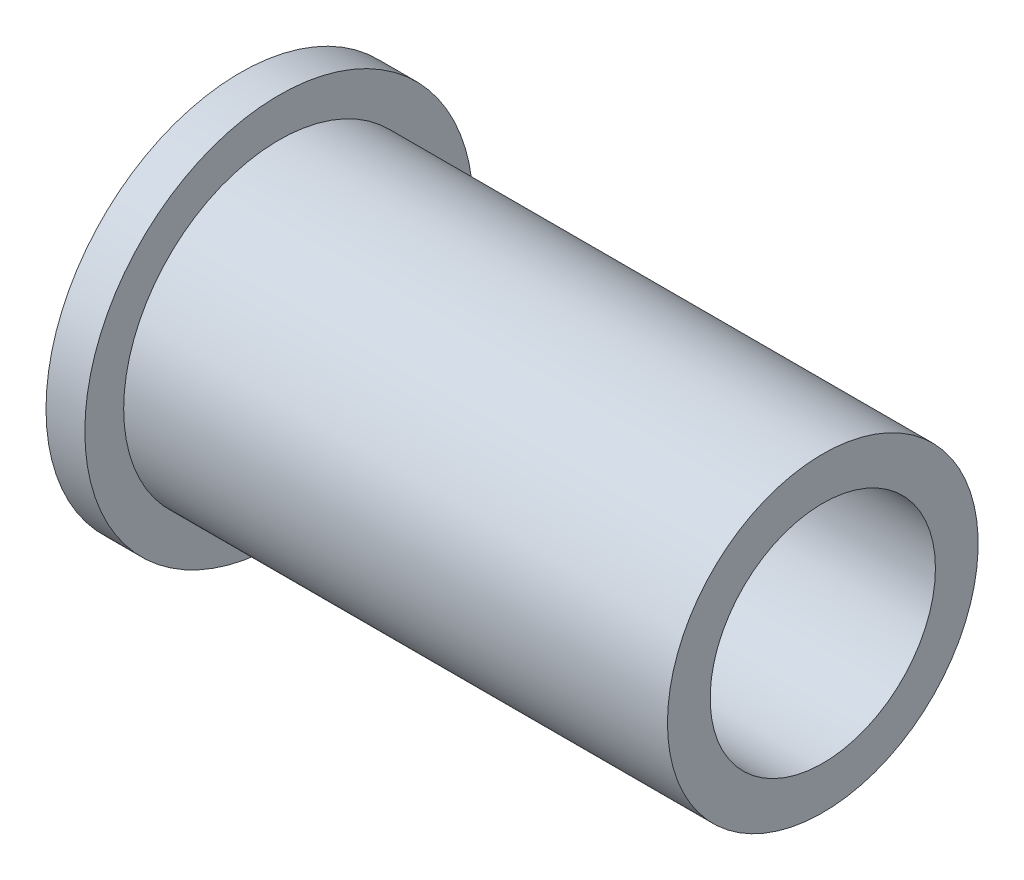
ISO-10303-21;
HEADER;
FILE_DESCRIPTION(('STEP AP214'),'2;1');
FILE_NAME('part.step','',(''),(''),'','','');
FILE_SCHEMA(('AUTOMOTIVE_DESIGN { 1 0 10303 214 1 1 1 1 }'));
ENDSEC;
DATA;
#1=APPLICATION_CONTEXT('core data for automotive mechanical design processes');
#2=APPLICATION_PROTOCOL_DEFINITION('international standard','automotive_design',2000,#1);
#3=PRODUCT_CONTEXT('',#1,'mechanical');
#4=PRODUCT('Part','Part','',(#3));
#5=PRODUCT_RELATED_PRODUCT_CATEGORY('part','',(#4));
#6=PRODUCT_DEFINITION_FORMATION('','',#4);
#7=PRODUCT_DEFINITION_CONTEXT('part definition',#1,'design');
#8=PRODUCT_DEFINITION('design','',#6,#7);
#9=PRODUCT_DEFINITION_SHAPE('','',#8);
#10=(LENGTH_UNIT() NAMED_UNIT(*) SI_UNIT(.MILLI.,.METRE.));
#11=(NAMED_UNIT(*) PLANE_ANGLE_UNIT() SI_UNIT($,.RADIAN.));
#12=(NAMED_UNIT(*) SI_UNIT($,.STERADIAN.) SOLID_ANGLE_UNIT());
#13=UNCERTAINTY_MEASURE_WITH_UNIT(LENGTH_MEASURE(1.E-05),#10,'distance_accuracy_value','');
#14=(GEOMETRIC_REPRESENTATION_CONTEXT(3) GLOBAL_UNCERTAINTY_ASSIGNED_CONTEXT((#13)) GLOBAL_UNIT_ASSIGNED_CONTEXT((#10,
#11,#12)) REPRESENTATION_CONTEXT('',''));
#15=CARTESIAN_POINT('',(0.,0.,0.));
#16=DIRECTION('',(0.,0.,1.));
#17=DIRECTION('',(1.,0.,0.));
#18=AXIS2_PLACEMENT_3D('',#15,#16,#17);
#19=CARTESIAN_POINT('',(14.7499999999999,0.,0.));
#20=DIRECTION('',(0.,0.,1.));
#21=DIRECTION('',(1.,0.,0.));
#22=AXIS2_PLACEMENT_3D('',#19,#20,#21);
#23=SPHERICAL_SURFACE('',#22,25.2499999999999);
#24=CARTESIAN_POINT('',(14.7499999999999,0.,0.));
#25=DIRECTION('',(-1.,0.,0.));
#26=DIRECTION('',(0.,0.,1.));
#27=AXIS2_PLACEMENT_3D('',#24,#25,#26);
#28=SPHERICAL_SURFACE('',#27,25.2499999999999);
#29=CARTESIAN_POINT('',(-10.,0.,0.));
#30=DIRECTION('',(-1.,0.,0.));
#31=DIRECTION('',(0.,0.,1.));
#32=AXIS2_PLACEMENT_3D('',#29,#30,#31);
#33=CIRCLE('',#32,5.);
#34=CARTESIAN_POINT('',(-10.,0.,5.));
#35=VERTEX_POINT('',#34);
#36=EDGE_CURVE('E11',#35,#35,#33,.T.);
#37=ORIENTED_EDGE('',*,*,#36,.T.);
#38=EDGE_LOOP('',(#37));
#39=FACE_BOUND('',#38,.T.);
#40=ADVANCED_FACE('F34',(#39),#28,.T.);
#41=CARTESIAN_POINT('',(-33.6191195795006,0.,0.));
#42=DIRECTION('',(-1.,0.,0.));
#43=DIRECTION('',(0.,0.,1.));
#44=AXIS2_PLACEMENT_3D('',#41,#42,#43);
#45=CYLINDRICAL_SURFACE('',#44,5.);
#46=ORIENTED_EDGE('',*,*,#36,.F.);
#47=EDGE_LOOP('',(#46));
#48=FACE_BOUND('',#47,.T.);
#49=CARTESIAN_POINT('',(-9.,0.,0.));
#50=DIRECTION('',(-1.,0.,0.));
#51=DIRECTION('',(0.,0.,1.));
#52=AXIS2_PLACEMENT_3D('',#49,#50,#51);
#53=CIRCLE('',#52,5.);
#54=CARTESIAN_POINT('',(-9.,0.,5.));
#55=VERTEX_POINT('',#54);
#56=EDGE_CURVE('E40',#55,#55,#53,.T.);
#57=ORIENTED_EDGE('',*,*,#56,.T.);
#58=EDGE_LOOP('',(#57));
#59=FACE_BOUND('',#58,.T.);
#60=ADVANCED_FACE('F66',(#48,#59),#45,.T.);
#61=CARTESIAN_POINT('',(-9.,5.,0.));
#62=DIRECTION('',(-1.,0.,0.));
#63=DIRECTION('',(0.,0.,1.));
#64=AXIS2_PLACEMENT_3D('',#61,#62,#63);
#65=PLANE('',#64);
#66=ORIENTED_EDGE('',*,*,#56,.F.);
#67=EDGE_LOOP('',(#66));
#68=FACE_BOUND('',#67,.T.);
#69=CARTESIAN_POINT('',(-9.,0.,0.));
#70=DIRECTION('',(-1.,0.,0.));
#71=DIRECTION('',(0.,0.,1.));
#72=AXIS2_PLACEMENT_3D('',#69,#70,#71);
#73=CIRCLE('',#72,4.);
#74=CARTESIAN_POINT('',(-9.,0.,4.));
#75=VERTEX_POINT('',#74);
#76=EDGE_CURVE('E57',#75,#75,#73,.T.);
#77=ORIENTED_EDGE('',*,*,#76,.T.);
#78=EDGE_LOOP('',(#77));
#79=FACE_BOUND('',#78,.T.);
#80=ADVANCED_FACE('F68',(#68,#79),#65,.F.);
#81=CARTESIAN_POINT('',(-33.6191195795006,0.,0.));
#82=DIRECTION('',(-1.,0.,0.));
#83=DIRECTION('',(0.,0.,1.));
#84=AXIS2_PLACEMENT_3D('',#81,#82,#83);
#85=CYLINDRICAL_SURFACE('',#84,4.);
#86=ORIENTED_EDGE('',*,*,#76,.F.);
#87=EDGE_LOOP('',(#86));
#88=FACE_BOUND('',#87,.T.);
#89=CARTESIAN_POINT('',(5.,0.,0.));
#90=DIRECTION('',(-1.,0.,0.));
#91=DIRECTION('',(0.,0.,1.));
#92=AXIS2_PLACEMENT_3D('',#89,#90,#91);
#93=CIRCLE('',#92,4.);
#94=CARTESIAN_POINT('',(5.,0.,4.));
#95=VERTEX_POINT('',#94);
#96=EDGE_CURVE('E53',#95,#95,#93,.T.);
#97=ORIENTED_EDGE('',*,*,#96,.T.);
#98=EDGE_LOOP('',(#97));
#99=FACE_BOUND('',#98,.T.);
#100=ADVANCED_FACE('F71',(#88,#99),#85,.T.);
#101=CARTESIAN_POINT('',(5.,4.,0.));
#102=DIRECTION('',(-1.,0.,0.));
#103=DIRECTION('',(0.,0.,1.));
#104=AXIS2_PLACEMENT_3D('',#101,#102,#103);
#105=PLANE('',#104);
#106=CARTESIAN_POINT('',(5.,0.,0.));
#107=DIRECTION('',(1.,0.,0.));
#108=DIRECTION('',(0.,0.,-1.));
#109=AXIS2_PLACEMENT_3D('',#106,#107,#108);
#110=CIRCLE('',#109,2.9);
#111=CARTESIAN_POINT('',(5.,0.,-2.9));
#112=VERTEX_POINT('',#111);
#113=EDGE_CURVE('E54',#112,#112,#110,.T.);
#114=ORIENTED_EDGE('',*,*,#113,.F.);
#115=EDGE_LOOP('',(#114));
#116=FACE_BOUND('',#115,.T.);
#117=ORIENTED_EDGE('',*,*,#96,.F.);
#118=EDGE_LOOP('',(#117));
#119=FACE_BOUND('',#118,.T.);
#120=ADVANCED_FACE('F47',(#116,#119),#105,.F.);
#121=CARTESIAN_POINT('',(-1.,0.,0.));
#122=DIRECTION('',(1.,0.,0.));
#123=DIRECTION('',(0.,0.,-1.));
#124=AXIS2_PLACEMENT_3D('',#121,#122,#123);
#125=CONICAL_SURFACE('',#124,2.9,1.18682389135614);
#126=CARTESIAN_POINT('',(-2.17167605492196,0.,0.));
#127=VERTEX_POINT('',#126);
#128=VERTEX_LOOP('',#127);
#129=FACE_BOUND('',#128,.T.);
#130=CARTESIAN_POINT('',(-1.,0.,0.));
#131=DIRECTION('',(1.,0.,0.));
#132=DIRECTION('',(0.,0.,-1.));
#133=AXIS2_PLACEMENT_3D('',#130,#131,#132);
#134=CIRCLE('',#133,2.9);
#135=CARTESIAN_POINT('',(-1.,0.,-2.9));
#136=VERTEX_POINT('',#135);
#137=EDGE_CURVE('E51',#136,#136,#134,.T.);
#138=ORIENTED_EDGE('',*,*,#137,.T.);
#139=EDGE_LOOP('',(#138));
#140=FACE_BOUND('',#139,.T.);
#141=ADVANCED_FACE('F43',(#129,#140),#125,.F.);
#142=CARTESIAN_POINT('',(5.,0.,0.));
#143=DIRECTION('',(1.,0.,0.));
#144=DIRECTION('',(0.,0.,-1.));
#145=AXIS2_PLACEMENT_3D('',#142,#143,#144);
#146=CYLINDRICAL_SURFACE('',#145,2.9);
#147=ORIENTED_EDGE('',*,*,#137,.F.);
#148=EDGE_LOOP('',(#147));
#149=FACE_BOUND('',#148,.T.);
#150=ORIENTED_EDGE('',*,*,#113,.T.);
#151=EDGE_LOOP('',(#150));
#152=FACE_BOUND('',#151,.T.);
#153=ADVANCED_FACE('F46',(#149,#152),#146,.F.);
#154=CLOSED_SHELL('',(#40,#60,#80,#100,#120,#141,#153));
#155=MANIFOLD_SOLID_BREP('B2',#154);
#156=ADVANCED_BREP_SHAPE_REPRESENTATION('',(#18,#155),#14);
#157=SHAPE_DEFINITION_REPRESENTATION(#9,#156);
ENDSEC;
END-ISO-10303-21;
